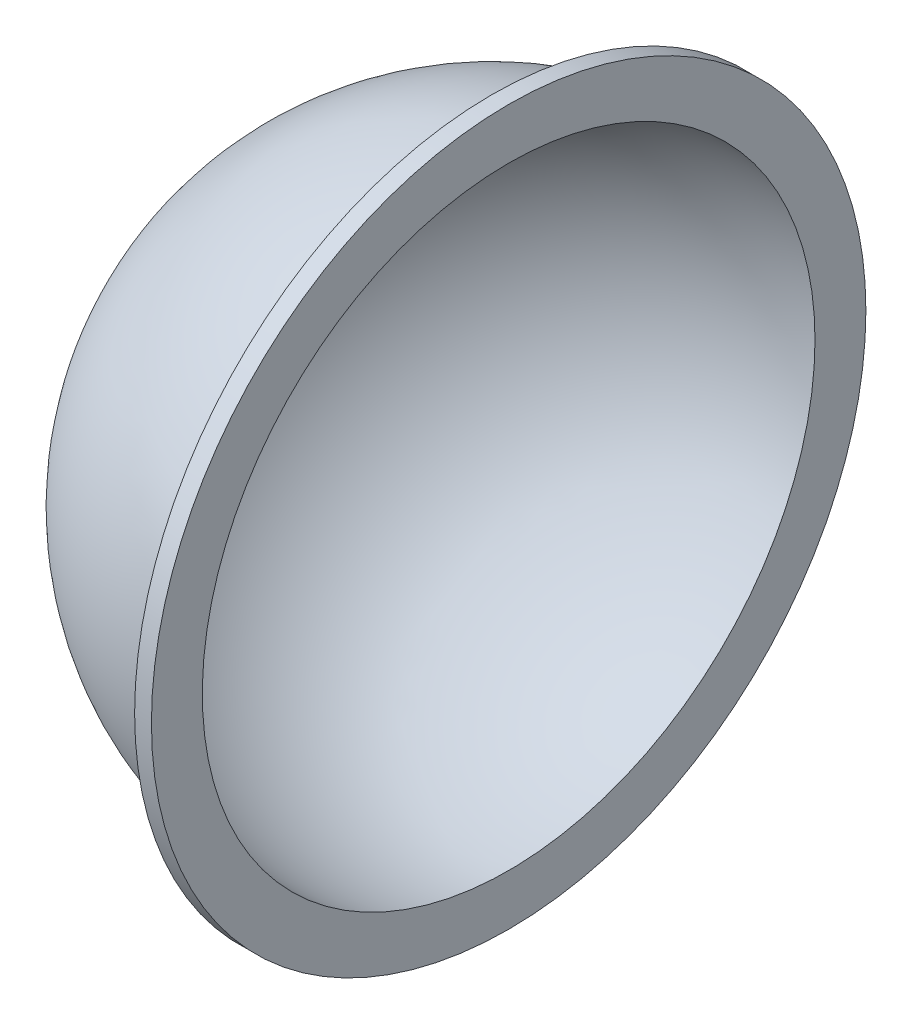
ISO-10303-21;
HEADER;
FILE_DESCRIPTION(('STEP AP214'),'2;1');
FILE_NAME('part.step','',(''),(''),'','','');
FILE_SCHEMA(('AUTOMOTIVE_DESIGN { 1 0 10303 214 1 1 1 1 }'));
ENDSEC;
DATA;
#1=APPLICATION_CONTEXT('core data for automotive mechanical design processes');
#2=APPLICATION_PROTOCOL_DEFINITION('international standard','automotive_design',2000,#1);
#3=PRODUCT_CONTEXT('',#1,'mechanical');
#4=PRODUCT('Part','Part','',(#3));
#5=PRODUCT_RELATED_PRODUCT_CATEGORY('part','',(#4));
#6=PRODUCT_DEFINITION_FORMATION('','',#4);
#7=PRODUCT_DEFINITION_CONTEXT('part definition',#1,'design');
#8=PRODUCT_DEFINITION('design','',#6,#7);
#9=PRODUCT_DEFINITION_SHAPE('','',#8);
#10=(LENGTH_UNIT() NAMED_UNIT(*) SI_UNIT(.MILLI.,.METRE.));
#11=(NAMED_UNIT(*) PLANE_ANGLE_UNIT() SI_UNIT($,.RADIAN.));
#12=(NAMED_UNIT(*) SI_UNIT($,.STERADIAN.) SOLID_ANGLE_UNIT());
#13=UNCERTAINTY_MEASURE_WITH_UNIT(LENGTH_MEASURE(1.E-05),#10,'distance_accuracy_value','');
#14=(GEOMETRIC_REPRESENTATION_CONTEXT(3) GLOBAL_UNCERTAINTY_ASSIGNED_CONTEXT((#13)) GLOBAL_UNIT_ASSIGNED_CONTEXT((#10,
#11,#12)) REPRESENTATION_CONTEXT('',''));
#15=CARTESIAN_POINT('',(0.,0.,0.));
#16=DIRECTION('',(0.,0.,1.));
#17=DIRECTION('',(1.,0.,0.));
#18=AXIS2_PLACEMENT_3D('',#15,#16,#17);
#19=CARTESIAN_POINT('',(0.,0.,0.));
#20=DIRECTION('',(1.,0.,0.));
#21=DIRECTION('',(0.,0.,-1.));
#22=AXIS2_PLACEMENT_3D('',#19,#20,#21);
#23=PLANE('',#22);
#24=CARTESIAN_POINT('',(0.,0.,0.));
#25=DIRECTION('',(1.,0.,0.));
#26=DIRECTION('',(0.,0.,-1.));
#27=AXIS2_PLACEMENT_3D('',#24,#25,#26);
#28=CIRCLE('',#27,42.5);
#29=CARTESIAN_POINT('',(0.,0.,-42.5));
#30=VERTEX_POINT('',#29);
#31=EDGE_CURVE('E47',#30,#30,#28,.T.);
#32=ORIENTED_EDGE('',*,*,#31,.F.);
#33=EDGE_LOOP('',(#32));
#34=FACE_BOUND('',#33,.T.);
#35=CARTESIAN_POINT('',(0.,0.,0.));
#36=DIRECTION('',(1.,0.,0.));
#37=DIRECTION('',(0.,0.,-1.));
#38=AXIS2_PLACEMENT_3D('',#35,#36,#37);
#39=CIRCLE('',#38,37.5);
#40=CARTESIAN_POINT('',(0.,0.,-37.5));
#41=VERTEX_POINT('',#40);
#42=EDGE_CURVE('E10',#41,#41,#39,.T.);
#43=ORIENTED_EDGE('',*,*,#42,.T.);
#44=EDGE_LOOP('',(#43));
#45=FACE_BOUND('',#44,.T.);
#46=ADVANCED_FACE('F33',(#34,#45),#23,.F.);
#47=CARTESIAN_POINT('',(0.,0.,0.));
#48=DIRECTION('',(1.,0.,0.));
#49=DIRECTION('',(0.,1.,0.));
#50=AXIS2_PLACEMENT_3D('',#47,#48,#49);
#51=SPHERICAL_SURFACE('',#50,37.5);
#52=ORIENTED_EDGE('',*,*,#42,.F.);
#53=EDGE_LOOP('',(#52));
#54=FACE_BOUND('',#53,.T.);
#55=ADVANCED_FACE('F56',(#54),#51,.T.);
#56=CARTESIAN_POINT('',(0.,0.,0.));
#57=DIRECTION('',(1.,0.,0.));
#58=DIRECTION('',(0.,1.,0.));
#59=AXIS2_PLACEMENT_3D('',#56,#57,#58);
#60=SPHERICAL_SURFACE('',#59,36.5);
#61=CARTESIAN_POINT('',(2.,0.,0.));
#62=DIRECTION('',(1.,0.,0.));
#63=DIRECTION('',(0.,0.,-1.));
#64=AXIS2_PLACEMENT_3D('',#61,#62,#63);
#65=CIRCLE('',#64,36.4451642882838);
#66=CARTESIAN_POINT('',(2.,0.,-36.4451642882838));
#67=VERTEX_POINT('',#66);
#68=EDGE_CURVE('E39',#67,#67,#65,.T.);
#69=ORIENTED_EDGE('',*,*,#68,.T.);
#70=EDGE_LOOP('',(#69));
#71=FACE_BOUND('',#70,.T.);
#72=ADVANCED_FACE('F60',(#71),#60,.F.);
#73=CARTESIAN_POINT('',(2.,0.,0.));
#74=DIRECTION('',(1.,0.,0.));
#75=DIRECTION('',(0.,0.,-1.));
#76=AXIS2_PLACEMENT_3D('',#73,#74,#75);
#77=PLANE('',#76);
#78=CARTESIAN_POINT('',(2.,0.,0.));
#79=DIRECTION('',(1.,0.,0.));
#80=DIRECTION('',(0.,0.,-1.));
#81=AXIS2_PLACEMENT_3D('',#78,#79,#80);
#82=CIRCLE('',#81,42.5);
#83=CARTESIAN_POINT('',(2.,0.,-42.5));
#84=VERTEX_POINT('',#83);
#85=EDGE_CURVE('E43',#84,#84,#82,.T.);
#86=ORIENTED_EDGE('',*,*,#85,.T.);
#87=EDGE_LOOP('',(#86));
#88=FACE_BOUND('',#87,.T.);
#89=ORIENTED_EDGE('',*,*,#68,.F.);
#90=EDGE_LOOP('',(#89));
#91=FACE_BOUND('',#90,.T.);
#92=ADVANCED_FACE('F65',(#88,#91),#77,.T.);
#93=CARTESIAN_POINT('',(0.,0.,0.));
#94=DIRECTION('',(1.,0.,0.));
#95=DIRECTION('',(0.,0.,-1.));
#96=AXIS2_PLACEMENT_3D('',#93,#94,#95);
#97=CYLINDRICAL_SURFACE('',#96,42.5);
#98=ORIENTED_EDGE('',*,*,#85,.F.);
#99=EDGE_LOOP('',(#98));
#100=FACE_BOUND('',#99,.T.);
#101=ORIENTED_EDGE('',*,*,#31,.T.);
#102=EDGE_LOOP('',(#101));
#103=FACE_BOUND('',#102,.T.);
#104=ADVANCED_FACE('F53',(#100,#103),#97,.T.);
#105=CLOSED_SHELL('',(#46,#55,#72,#92,#104));
#106=MANIFOLD_SOLID_BREP('B2',#105);
#107=ADVANCED_BREP_SHAPE_REPRESENTATION('',(#18,#106),#14);
#108=SHAPE_DEFINITION_REPRESENTATION(#9,#107);
ENDSEC;
END-ISO-10303-21;
